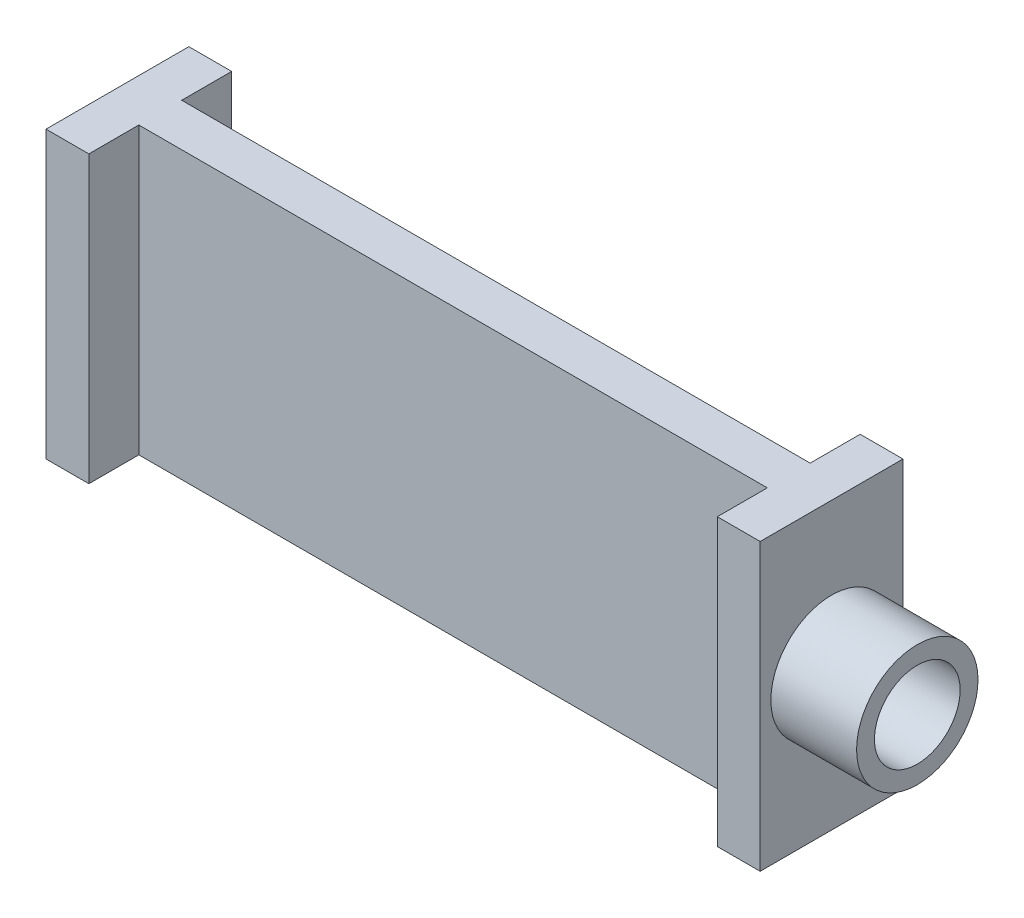
ISO-10303-21;
HEADER;
FILE_DESCRIPTION(('STEP AP214'),'2;1');
FILE_NAME('part.step','',(''),(''),'','','');
FILE_SCHEMA(('AUTOMOTIVE_DESIGN { 1 0 10303 214 1 1 1 1 }'));
ENDSEC;
DATA;
#1=APPLICATION_CONTEXT('core data for automotive mechanical design processes');
#2=APPLICATION_PROTOCOL_DEFINITION('international standard','automotive_design',2000,#1);
#3=PRODUCT_CONTEXT('',#1,'mechanical');
#4=PRODUCT('Part','Part','',(#3));
#5=PRODUCT_RELATED_PRODUCT_CATEGORY('part','',(#4));
#6=PRODUCT_DEFINITION_FORMATION('','',#4);
#7=PRODUCT_DEFINITION_CONTEXT('part definition',#1,'design');
#8=PRODUCT_DEFINITION('design','',#6,#7);
#9=PRODUCT_DEFINITION_SHAPE('','',#8);
#10=(LENGTH_UNIT() NAMED_UNIT(*) SI_UNIT(.MILLI.,.METRE.));
#11=(NAMED_UNIT(*) PLANE_ANGLE_UNIT() SI_UNIT($,.RADIAN.));
#12=(NAMED_UNIT(*) SI_UNIT($,.STERADIAN.) SOLID_ANGLE_UNIT());
#13=UNCERTAINTY_MEASURE_WITH_UNIT(LENGTH_MEASURE(1.E-05),#10,'distance_accuracy_value','');
#14=(GEOMETRIC_REPRESENTATION_CONTEXT(3) GLOBAL_UNCERTAINTY_ASSIGNED_CONTEXT((#13)) GLOBAL_UNIT_ASSIGNED_CONTEXT((#10,
#11,#12)) REPRESENTATION_CONTEXT('',''));
#15=CARTESIAN_POINT('',(0.,0.,0.));
#16=DIRECTION('',(0.,0.,1.));
#17=DIRECTION('',(1.,0.,0.));
#18=AXIS2_PLACEMENT_3D('',#15,#16,#17);
#19=CARTESIAN_POINT('',(6.,40.,0.));
#20=DIRECTION('',(0.,0.,-1.));
#21=DIRECTION('',(-1.,0.,0.));
#22=AXIS2_PLACEMENT_3D('',#19,#20,#21);
#23=PLANE('',#22);
#24=DIRECTION('',(1.,0.,0.));
#25=VECTOR('',#24,1.);
#26=CARTESIAN_POINT('',(6.,0.,0.));
#27=LINE('',#26,#25);
#28=CARTESIAN_POINT('',(0.,0.,0.));
#29=VERTEX_POINT('',#28);
#30=CARTESIAN_POINT('',(6.,0.,0.));
#31=VERTEX_POINT('',#30);
#32=EDGE_CURVE('E165',#29,#31,#27,.T.);
#33=ORIENTED_EDGE('',*,*,#32,.T.);
#34=DIRECTION('',(0.,-1.,0.));
#35=VECTOR('',#34,1.);
#36=CARTESIAN_POINT('',(6.,40.,0.));
#37=LINE('',#36,#35);
#38=CARTESIAN_POINT('',(6.,40.,0.));
#39=VERTEX_POINT('',#38);
#40=EDGE_CURVE('E52',#39,#31,#37,.T.);
#41=ORIENTED_EDGE('',*,*,#40,.F.);
#42=DIRECTION('',(1.,0.,0.));
#43=VECTOR('',#42,1.);
#44=CARTESIAN_POINT('',(6.,40.,0.));
#45=LINE('',#44,#43);
#46=CARTESIAN_POINT('',(0.,40.,0.));
#47=VERTEX_POINT('',#46);
#48=EDGE_CURVE('E188',#47,#39,#45,.T.);
#49=ORIENTED_EDGE('',*,*,#48,.F.);
#50=DIRECTION('',(0.,-1.,0.));
#51=VECTOR('',#50,1.);
#52=CARTESIAN_POINT('',(0.,40.,0.));
#53=LINE('',#52,#51);
#54=EDGE_CURVE('E161',#47,#29,#53,.T.);
#55=ORIENTED_EDGE('',*,*,#54,.T.);
#56=EDGE_LOOP('',(#33,#41,#49,#55));
#57=FACE_BOUND('',#56,.T.);
#58=ADVANCED_FACE('F44',(#57),#23,.F.);
#59=CARTESIAN_POINT('',(6.,40.,-6.99999999999999));
#60=DIRECTION('',(-1.,0.,0.));
#61=DIRECTION('',(0.,0.,1.));
#62=AXIS2_PLACEMENT_3D('',#59,#60,#61);
#63=PLANE('',#62);
#64=DIRECTION('',(0.,0.,-1.));
#65=VECTOR('',#64,1.);
#66=CARTESIAN_POINT('',(6.,0.,-6.99999999999999));
#67=LINE('',#66,#65);
#68=CARTESIAN_POINT('',(6.,0.,-6.99999999999999));
#69=VERTEX_POINT('',#68);
#70=EDGE_CURVE('E168',#31,#69,#67,.T.);
#71=ORIENTED_EDGE('',*,*,#70,.T.);
#72=DIRECTION('',(0.,-1.,0.));
#73=VECTOR('',#72,1.);
#74=CARTESIAN_POINT('',(6.,40.,-6.99999999999999));
#75=LINE('',#74,#73);
#76=CARTESIAN_POINT('',(6.,40.,-6.99999999999999));
#77=VERTEX_POINT('',#76);
#78=EDGE_CURVE('E210',#77,#69,#75,.T.);
#79=ORIENTED_EDGE('',*,*,#78,.F.);
#80=DIRECTION('',(0.,0.,-1.));
#81=VECTOR('',#80,1.);
#82=CARTESIAN_POINT('',(6.,40.,-6.99999999999999));
#83=LINE('',#82,#81);
#84=EDGE_CURVE('E116',#39,#77,#83,.T.);
#85=ORIENTED_EDGE('',*,*,#84,.F.);
#86=ORIENTED_EDGE('',*,*,#40,.T.);
#87=EDGE_LOOP('',(#71,#79,#85,#86));
#88=FACE_BOUND('',#87,.T.);
#89=ADVANCED_FACE('F213',(#88),#63,.F.);
#90=CARTESIAN_POINT('',(94.,40.,-7.00000000000001));
#91=DIRECTION('',(0.,0.,-1.));
#92=DIRECTION('',(-1.,0.,0.));
#93=AXIS2_PLACEMENT_3D('',#90,#91,#92);
#94=PLANE('',#93);
#95=DIRECTION('',(1.,0.,0.));
#96=VECTOR('',#95,1.);
#97=CARTESIAN_POINT('',(94.,0.,-7.00000000000001));
#98=LINE('',#97,#96);
#99=CARTESIAN_POINT('',(94.,0.,-7.00000000000001));
#100=VERTEX_POINT('',#99);
#101=EDGE_CURVE('E171',#69,#100,#98,.T.);
#102=ORIENTED_EDGE('',*,*,#101,.T.);
#103=DIRECTION('',(0.,-1.,0.));
#104=VECTOR('',#103,1.);
#105=CARTESIAN_POINT('',(94.,40.,-7.00000000000001));
#106=LINE('',#105,#104);
#107=CARTESIAN_POINT('',(94.,40.,-7.00000000000001));
#108=VERTEX_POINT('',#107);
#109=EDGE_CURVE('E207',#108,#100,#106,.T.);
#110=ORIENTED_EDGE('',*,*,#109,.F.);
#111=DIRECTION('',(1.,0.,0.));
#112=VECTOR('',#111,1.);
#113=CARTESIAN_POINT('',(94.,40.,-7.00000000000001));
#114=LINE('',#113,#112);
#115=EDGE_CURVE('E233',#77,#108,#114,.T.);
#116=ORIENTED_EDGE('',*,*,#115,.F.);
#117=ORIENTED_EDGE('',*,*,#78,.T.);
#118=EDGE_LOOP('',(#102,#110,#116,#117));
#119=FACE_BOUND('',#118,.T.);
#120=ADVANCED_FACE('F224',(#119),#94,.F.);
#121=CARTESIAN_POINT('',(94.,40.,0.));
#122=DIRECTION('',(1.,0.,0.));
#123=DIRECTION('',(0.,0.,-1.));
#124=AXIS2_PLACEMENT_3D('',#121,#122,#123);
#125=PLANE('',#124);
#126=DIRECTION('',(0.,0.,1.));
#127=VECTOR('',#126,1.);
#128=CARTESIAN_POINT('',(94.,0.,0.));
#129=LINE('',#128,#127);
#130=CARTESIAN_POINT('',(94.,0.,0.));
#131=VERTEX_POINT('',#130);
#132=EDGE_CURVE('E173',#100,#131,#129,.T.);
#133=ORIENTED_EDGE('',*,*,#132,.T.);
#134=DIRECTION('',(0.,-1.,0.));
#135=VECTOR('',#134,1.);
#136=CARTESIAN_POINT('',(94.,40.,0.));
#137=LINE('',#136,#135);
#138=CARTESIAN_POINT('',(94.,40.,0.));
#139=VERTEX_POINT('',#138);
#140=EDGE_CURVE('E204',#139,#131,#137,.T.);
#141=ORIENTED_EDGE('',*,*,#140,.F.);
#142=DIRECTION('',(0.,0.,1.));
#143=VECTOR('',#142,1.);
#144=CARTESIAN_POINT('',(94.,40.,0.));
#145=LINE('',#144,#143);
#146=EDGE_CURVE('E230',#108,#139,#145,.T.);
#147=ORIENTED_EDGE('',*,*,#146,.F.);
#148=ORIENTED_EDGE('',*,*,#109,.T.);
#149=EDGE_LOOP('',(#133,#141,#147,#148));
#150=FACE_BOUND('',#149,.T.);
#151=ADVANCED_FACE('F228',(#150),#125,.F.);
#152=CARTESIAN_POINT('',(100.,40.,0.));
#153=DIRECTION('',(0.,0.,-1.));
#154=DIRECTION('',(-1.,0.,0.));
#155=AXIS2_PLACEMENT_3D('',#152,#153,#154);
#156=PLANE('',#155);
#157=DIRECTION('',(1.,0.,0.));
#158=VECTOR('',#157,1.);
#159=CARTESIAN_POINT('',(100.,0.,0.));
#160=LINE('',#159,#158);
#161=CARTESIAN_POINT('',(100.,0.,0.));
#162=VERTEX_POINT('',#161);
#163=EDGE_CURVE('E175',#131,#162,#160,.T.);
#164=ORIENTED_EDGE('',*,*,#163,.T.);
#165=DIRECTION('',(0.,-1.,0.));
#166=VECTOR('',#165,1.);
#167=CARTESIAN_POINT('',(100.,40.,0.));
#168=LINE('',#167,#166);
#169=CARTESIAN_POINT('',(100.,40.,0.));
#170=VERTEX_POINT('',#169);
#171=EDGE_CURVE('E201',#170,#162,#168,.T.);
#172=ORIENTED_EDGE('',*,*,#171,.F.);
#173=DIRECTION('',(1.,0.,0.));
#174=VECTOR('',#173,1.);
#175=CARTESIAN_POINT('',(100.,40.,0.));
#176=LINE('',#175,#174);
#177=EDGE_CURVE('E232',#139,#170,#176,.T.);
#178=ORIENTED_EDGE('',*,*,#177,.F.);
#179=ORIENTED_EDGE('',*,*,#140,.T.);
#180=EDGE_LOOP('',(#164,#172,#178,#179));
#181=FACE_BOUND('',#180,.T.);
#182=ADVANCED_FACE('F264',(#181),#156,.F.);
#183=CARTESIAN_POINT('',(100.,40.,-20.));
#184=DIRECTION('',(-1.,0.,0.));
#185=DIRECTION('',(0.,0.,1.));
#186=AXIS2_PLACEMENT_3D('',#183,#184,#185);
#187=PLANE('',#186);
#188=CARTESIAN_POINT('',(100.,20.,-10.));
#189=DIRECTION('',(-1.,0.,0.));
#190=DIRECTION('',(0.,0.,1.));
#191=AXIS2_PLACEMENT_3D('',#188,#189,#190);
#192=CIRCLE('',#191,8.5);
#193=CARTESIAN_POINT('',(100.,20.,-1.5));
#194=VERTEX_POINT('',#193);
#195=EDGE_CURVE('E13',#194,#194,#192,.F.);
#196=ORIENTED_EDGE('',*,*,#195,.F.);
#197=EDGE_LOOP('',(#196));
#198=FACE_BOUND('',#197,.T.);
#199=DIRECTION('',(0.,0.,-1.));
#200=VECTOR('',#199,1.);
#201=CARTESIAN_POINT('',(100.,0.,-20.));
#202=LINE('',#201,#200);
#203=CARTESIAN_POINT('',(100.,0.,-20.));
#204=VERTEX_POINT('',#203);
#205=EDGE_CURVE('E177',#162,#204,#202,.T.);
#206=ORIENTED_EDGE('',*,*,#205,.T.);
#207=DIRECTION('',(0.,-1.,0.));
#208=VECTOR('',#207,1.);
#209=CARTESIAN_POINT('',(100.,40.,-20.));
#210=LINE('',#209,#208);
#211=CARTESIAN_POINT('',(100.,40.,-20.));
#212=VERTEX_POINT('',#211);
#213=EDGE_CURVE('E198',#212,#204,#210,.T.);
#214=ORIENTED_EDGE('',*,*,#213,.F.);
#215=DIRECTION('',(0.,0.,-1.));
#216=VECTOR('',#215,1.);
#217=CARTESIAN_POINT('',(100.,40.,-20.));
#218=LINE('',#217,#216);
#219=EDGE_CURVE('E235',#170,#212,#218,.T.);
#220=ORIENTED_EDGE('',*,*,#219,.F.);
#221=ORIENTED_EDGE('',*,*,#171,.T.);
#222=EDGE_LOOP('',(#206,#214,#220,#221));
#223=FACE_BOUND('',#222,.T.);
#224=ADVANCED_FACE('F261',(#198,#223),#187,.F.);
#225=CARTESIAN_POINT('',(94.,40.,-20.0000000000001));
#226=DIRECTION('',(0.,0.,1.));
#227=DIRECTION('',(1.,0.,0.));
#228=AXIS2_PLACEMENT_3D('',#225,#226,#227);
#229=PLANE('',#228);
#230=DIRECTION('',(-1.,0.,0.));
#231=VECTOR('',#230,1.);
#232=CARTESIAN_POINT('',(94.,0.,-20.0000000000001));
#233=LINE('',#232,#231);
#234=CARTESIAN_POINT('',(94.,0.,-20.0000000000001));
#235=VERTEX_POINT('',#234);
#236=EDGE_CURVE('E179',#204,#235,#233,.T.);
#237=ORIENTED_EDGE('',*,*,#236,.T.);
#238=DIRECTION('',(0.,-1.,0.));
#239=VECTOR('',#238,1.);
#240=CARTESIAN_POINT('',(94.,40.,-20.0000000000001));
#241=LINE('',#240,#239);
#242=CARTESIAN_POINT('',(94.,40.,-20.0000000000001));
#243=VERTEX_POINT('',#242);
#244=EDGE_CURVE('E195',#243,#235,#241,.T.);
#245=ORIENTED_EDGE('',*,*,#244,.F.);
#246=DIRECTION('',(-1.,0.,0.));
#247=VECTOR('',#246,1.);
#248=CARTESIAN_POINT('',(94.,40.,-20.0000000000001));
#249=LINE('',#248,#247);
#250=EDGE_CURVE('E241',#212,#243,#249,.T.);
#251=ORIENTED_EDGE('',*,*,#250,.F.);
#252=ORIENTED_EDGE('',*,*,#213,.T.);
#253=EDGE_LOOP('',(#237,#245,#251,#252));
#254=FACE_BOUND('',#253,.T.);
#255=ADVANCED_FACE('F257',(#254),#229,.F.);
#256=CARTESIAN_POINT('',(94.,40.,-13.));
#257=DIRECTION('',(1.,0.,0.));
#258=DIRECTION('',(0.,0.,-1.));
#259=AXIS2_PLACEMENT_3D('',#256,#257,#258);
#260=PLANE('',#259);
#261=DIRECTION('',(0.,0.,1.));
#262=VECTOR('',#261,1.);
#263=CARTESIAN_POINT('',(94.,0.,-13.));
#264=LINE('',#263,#262);
#265=CARTESIAN_POINT('',(94.,0.,-13.));
#266=VERTEX_POINT('',#265);
#267=EDGE_CURVE('E181',#235,#266,#264,.T.);
#268=ORIENTED_EDGE('',*,*,#267,.T.);
#269=DIRECTION('',(0.,-1.,0.));
#270=VECTOR('',#269,1.);
#271=CARTESIAN_POINT('',(94.,40.,-13.));
#272=LINE('',#271,#270);
#273=CARTESIAN_POINT('',(94.,40.,-13.));
#274=VERTEX_POINT('',#273);
#275=EDGE_CURVE('E192',#274,#266,#272,.T.);
#276=ORIENTED_EDGE('',*,*,#275,.F.);
#277=DIRECTION('',(0.,0.,1.));
#278=VECTOR('',#277,1.);
#279=CARTESIAN_POINT('',(94.,40.,-13.));
#280=LINE('',#279,#278);
#281=EDGE_CURVE('E243',#243,#274,#280,.T.);
#282=ORIENTED_EDGE('',*,*,#281,.F.);
#283=ORIENTED_EDGE('',*,*,#244,.T.);
#284=EDGE_LOOP('',(#268,#276,#282,#283));
#285=FACE_BOUND('',#284,.T.);
#286=ADVANCED_FACE('F249',(#285),#260,.F.);
#287=CARTESIAN_POINT('',(6.,40.,-13.));
#288=DIRECTION('',(0.,0.,1.));
#289=DIRECTION('',(1.,0.,0.));
#290=AXIS2_PLACEMENT_3D('',#287,#288,#289);
#291=PLANE('',#290);
#292=DIRECTION('',(-1.,0.,0.));
#293=VECTOR('',#292,1.);
#294=CARTESIAN_POINT('',(6.,0.,-13.));
#295=LINE('',#294,#293);
#296=CARTESIAN_POINT('',(6.,0.,-13.));
#297=VERTEX_POINT('',#296);
#298=EDGE_CURVE('E183',#266,#297,#295,.T.);
#299=ORIENTED_EDGE('',*,*,#298,.T.);
#300=DIRECTION('',(0.,-1.,0.));
#301=VECTOR('',#300,1.);
#302=CARTESIAN_POINT('',(6.,40.,-13.));
#303=LINE('',#302,#301);
#304=CARTESIAN_POINT('',(6.,40.,-13.));
#305=VERTEX_POINT('',#304);
#306=EDGE_CURVE('E156',#305,#297,#303,.T.);
#307=ORIENTED_EDGE('',*,*,#306,.F.);
#308=DIRECTION('',(-1.,0.,0.));
#309=VECTOR('',#308,1.);
#310=CARTESIAN_POINT('',(6.,40.,-13.));
#311=LINE('',#310,#309);
#312=EDGE_CURVE('E147',#274,#305,#311,.T.);
#313=ORIENTED_EDGE('',*,*,#312,.F.);
#314=ORIENTED_EDGE('',*,*,#275,.T.);
#315=EDGE_LOOP('',(#299,#307,#313,#314));
#316=FACE_BOUND('',#315,.T.);
#317=ADVANCED_FACE('F253',(#316),#291,.F.);
#318=CARTESIAN_POINT('',(6.,40.,-20.));
#319=DIRECTION('',(-1.,0.,0.));
#320=DIRECTION('',(0.,0.,1.));
#321=AXIS2_PLACEMENT_3D('',#318,#319,#320);
#322=PLANE('',#321);
#323=DIRECTION('',(0.,0.,-1.));
#324=VECTOR('',#323,1.);
#325=CARTESIAN_POINT('',(6.,0.,-20.));
#326=LINE('',#325,#324);
#327=CARTESIAN_POINT('',(6.,0.,-20.));
#328=VERTEX_POINT('',#327);
#329=EDGE_CURVE('E155',#297,#328,#326,.T.);
#330=ORIENTED_EDGE('',*,*,#329,.T.);
#331=DIRECTION('',(0.,-1.,0.));
#332=VECTOR('',#331,1.);
#333=CARTESIAN_POINT('',(6.,40.,-20.));
#334=LINE('',#333,#332);
#335=CARTESIAN_POINT('',(6.,40.,-20.));
#336=VERTEX_POINT('',#335);
#337=EDGE_CURVE('E152',#336,#328,#334,.T.);
#338=ORIENTED_EDGE('',*,*,#337,.F.);
#339=DIRECTION('',(0.,0.,-1.));
#340=VECTOR('',#339,1.);
#341=CARTESIAN_POINT('',(6.,40.,-20.));
#342=LINE('',#341,#340);
#343=EDGE_CURVE('E141',#305,#336,#342,.T.);
#344=ORIENTED_EDGE('',*,*,#343,.F.);
#345=ORIENTED_EDGE('',*,*,#306,.T.);
#346=EDGE_LOOP('',(#330,#338,#344,#345));
#347=FACE_BOUND('',#346,.T.);
#348=ADVANCED_FACE('F153',(#347),#322,.F.);
#349=CARTESIAN_POINT('',(0.,40.,-20.));
#350=DIRECTION('',(0.,0.,1.));
#351=DIRECTION('',(1.,0.,0.));
#352=AXIS2_PLACEMENT_3D('',#349,#350,#351);
#353=PLANE('',#352);
#354=DIRECTION('',(-1.,0.,0.));
#355=VECTOR('',#354,1.);
#356=CARTESIAN_POINT('',(0.,0.,-20.));
#357=LINE('',#356,#355);
#358=CARTESIAN_POINT('',(0.,0.,-20.));
#359=VERTEX_POINT('',#358);
#360=EDGE_CURVE('E101',#328,#359,#357,.T.);
#361=ORIENTED_EDGE('',*,*,#360,.T.);
#362=DIRECTION('',(0.,-1.,0.));
#363=VECTOR('',#362,1.);
#364=CARTESIAN_POINT('',(0.,40.,-20.));
#365=LINE('',#364,#363);
#366=CARTESIAN_POINT('',(0.,40.,-20.));
#367=VERTEX_POINT('',#366);
#368=EDGE_CURVE('E157',#367,#359,#365,.T.);
#369=ORIENTED_EDGE('',*,*,#368,.F.);
#370=DIRECTION('',(-1.,0.,0.));
#371=VECTOR('',#370,1.);
#372=CARTESIAN_POINT('',(0.,40.,-20.));
#373=LINE('',#372,#371);
#374=EDGE_CURVE('E145',#336,#367,#373,.T.);
#375=ORIENTED_EDGE('',*,*,#374,.F.);
#376=ORIENTED_EDGE('',*,*,#337,.T.);
#377=EDGE_LOOP('',(#361,#369,#375,#376));
#378=FACE_BOUND('',#377,.T.);
#379=ADVANCED_FACE('F159',(#378),#353,.F.);
#380=CARTESIAN_POINT('',(0.,40.,0.));
#381=DIRECTION('',(1.,0.,0.));
#382=DIRECTION('',(0.,0.,-1.));
#383=AXIS2_PLACEMENT_3D('',#380,#381,#382);
#384=PLANE('',#383);
#385=DIRECTION('',(0.,0.,1.));
#386=VECTOR('',#385,1.);
#387=CARTESIAN_POINT('',(0.,0.,0.));
#388=LINE('',#387,#386);
#389=EDGE_CURVE('E107',#359,#29,#388,.T.);
#390=ORIENTED_EDGE('',*,*,#389,.T.);
#391=ORIENTED_EDGE('',*,*,#54,.F.);
#392=DIRECTION('',(0.,0.,1.));
#393=VECTOR('',#392,1.);
#394=CARTESIAN_POINT('',(0.,40.,0.));
#395=LINE('',#394,#393);
#396=EDGE_CURVE('E60',#367,#47,#395,.T.);
#397=ORIENTED_EDGE('',*,*,#396,.F.);
#398=ORIENTED_EDGE('',*,*,#368,.T.);
#399=EDGE_LOOP('',(#390,#391,#397,#398));
#400=FACE_BOUND('',#399,.T.);
#401=ADVANCED_FACE('F335',(#400),#384,.F.);
#402=CARTESIAN_POINT('',(0.,40.,0.));
#403=DIRECTION('',(0.,-1.,0.));
#404=DIRECTION('',(0.,0.,-1.));
#405=AXIS2_PLACEMENT_3D('',#402,#403,#404);
#406=PLANE('',#405);
#407=ORIENTED_EDGE('',*,*,#48,.T.);
#408=ORIENTED_EDGE('',*,*,#84,.T.);
#409=ORIENTED_EDGE('',*,*,#115,.T.);
#410=ORIENTED_EDGE('',*,*,#146,.T.);
#411=ORIENTED_EDGE('',*,*,#177,.T.);
#412=ORIENTED_EDGE('',*,*,#219,.T.);
#413=ORIENTED_EDGE('',*,*,#250,.T.);
#414=ORIENTED_EDGE('',*,*,#281,.T.);
#415=ORIENTED_EDGE('',*,*,#312,.T.);
#416=ORIENTED_EDGE('',*,*,#343,.T.);
#417=ORIENTED_EDGE('',*,*,#374,.T.);
#418=ORIENTED_EDGE('',*,*,#396,.T.);
#419=EDGE_LOOP('',(#407,#408,#409,#410,#411,#412,#413,#414,#415,#416,#417,#418));
#420=FACE_BOUND('',#419,.T.);
#421=ADVANCED_FACE('F143',(#420),#406,.F.);
#422=CARTESIAN_POINT('',(0.,0.,0.));
#423=DIRECTION('',(0.,-1.,0.));
#424=DIRECTION('',(0.,0.,-1.));
#425=AXIS2_PLACEMENT_3D('',#422,#423,#424);
#426=PLANE('',#425);
#427=ORIENTED_EDGE('',*,*,#32,.F.);
#428=ORIENTED_EDGE('',*,*,#389,.F.);
#429=ORIENTED_EDGE('',*,*,#360,.F.);
#430=ORIENTED_EDGE('',*,*,#329,.F.);
#431=ORIENTED_EDGE('',*,*,#298,.F.);
#432=ORIENTED_EDGE('',*,*,#267,.F.);
#433=ORIENTED_EDGE('',*,*,#236,.F.);
#434=ORIENTED_EDGE('',*,*,#205,.F.);
#435=ORIENTED_EDGE('',*,*,#163,.F.);
#436=ORIENTED_EDGE('',*,*,#132,.F.);
#437=ORIENTED_EDGE('',*,*,#101,.F.);
#438=ORIENTED_EDGE('',*,*,#70,.F.);
#439=EDGE_LOOP('',(#427,#428,#429,#430,#431,#432,#433,#434,#435,#436,#437,#438));
#440=FACE_BOUND('',#439,.T.);
#441=ADVANCED_FACE('F218',(#440),#426,.T.);
#442=CARTESIAN_POINT('',(112.,20.,-10.));
#443=DIRECTION('',(1.,0.,0.));
#444=DIRECTION('',(0.,0.,-1.));
#445=AXIS2_PLACEMENT_3D('',#442,#443,#444);
#446=PLANE('',#445);
#447=CARTESIAN_POINT('',(112.,20.,-10.));
#448=DIRECTION('',(1.,0.,0.));
#449=DIRECTION('',(0.,0.,-1.));
#450=AXIS2_PLACEMENT_3D('',#447,#448,#449);
#451=CIRCLE('',#450,8.5);
#452=CARTESIAN_POINT('',(112.,20.,-18.5));
#453=VERTEX_POINT('',#452);
#454=EDGE_CURVE('E169',#453,#453,#451,.T.);
#455=ORIENTED_EDGE('',*,*,#454,.T.);
#456=EDGE_LOOP('',(#455));
#457=FACE_BOUND('',#456,.T.);
#458=CARTESIAN_POINT('',(112.,20.,-10.));
#459=DIRECTION('',(1.,0.,0.));
#460=DIRECTION('',(0.,0.,-1.));
#461=AXIS2_PLACEMENT_3D('',#458,#459,#460);
#462=CIRCLE('',#461,6.);
#463=CARTESIAN_POINT('',(112.,20.,-16.));
#464=VERTEX_POINT('',#463);
#465=EDGE_CURVE('E410',#464,#464,#462,.T.);
#466=ORIENTED_EDGE('',*,*,#465,.F.);
#467=EDGE_LOOP('',(#466));
#468=FACE_BOUND('',#467,.T.);
#469=ADVANCED_FACE('F360',(#457,#468),#446,.T.);
#470=CARTESIAN_POINT('',(112.,20.,-10.));
#471=DIRECTION('',(-1.,0.,0.));
#472=DIRECTION('',(0.,0.,1.));
#473=AXIS2_PLACEMENT_3D('',#470,#471,#472);
#474=CYLINDRICAL_SURFACE('',#473,8.5);
#475=ORIENTED_EDGE('',*,*,#454,.F.);
#476=EDGE_LOOP('',(#475));
#477=FACE_BOUND('',#476,.T.);
#478=ORIENTED_EDGE('',*,*,#195,.T.);
#479=EDGE_LOOP('',(#478));
#480=FACE_BOUND('',#479,.T.);
#481=ADVANCED_FACE('F375',(#477,#480),#474,.T.);
#482=CARTESIAN_POINT('',(112.,20.,-10.));
#483=DIRECTION('',(-1.,0.,0.));
#484=DIRECTION('',(0.,0.,1.));
#485=AXIS2_PLACEMENT_3D('',#482,#483,#484);
#486=CYLINDRICAL_SURFACE('',#485,6.);
#487=ORIENTED_EDGE('',*,*,#465,.T.);
#488=EDGE_LOOP('',(#487));
#489=FACE_BOUND('',#488,.T.);
#490=CARTESIAN_POINT('',(100.,20.,-10.));
#491=DIRECTION('',(1.,0.,0.));
#492=DIRECTION('',(0.,0.,-1.));
#493=AXIS2_PLACEMENT_3D('',#490,#491,#492);
#494=CIRCLE('',#493,6.);
#495=CARTESIAN_POINT('',(100.,20.,-16.));
#496=VERTEX_POINT('',#495);
#497=EDGE_CURVE('E408',#496,#496,#494,.T.);
#498=ORIENTED_EDGE('',*,*,#497,.F.);
#499=EDGE_LOOP('',(#498));
#500=FACE_BOUND('',#499,.T.);
#501=ADVANCED_FACE('F385',(#489,#500),#486,.F.);
#502=ORIENTED_EDGE('',*,*,#497,.T.);
#503=EDGE_LOOP('',(#502));
#504=FACE_BOUND('',#503,.T.);
#505=ADVANCED_FACE('F273',(#504),#187,.F.);
#506=CLOSED_SHELL('',(#58,#89,#120,#151,#182,#224,#255,#286,#317,#348,#379,#401,#421,#441,#469,
#481,#501,#505));
#507=MANIFOLD_SOLID_BREP('B2',#506);
#508=ADVANCED_BREP_SHAPE_REPRESENTATION('',(#18,#507),#14);
#509=SHAPE_DEFINITION_REPRESENTATION(#9,#508);
ENDSEC;
END-ISO-10303-21;
